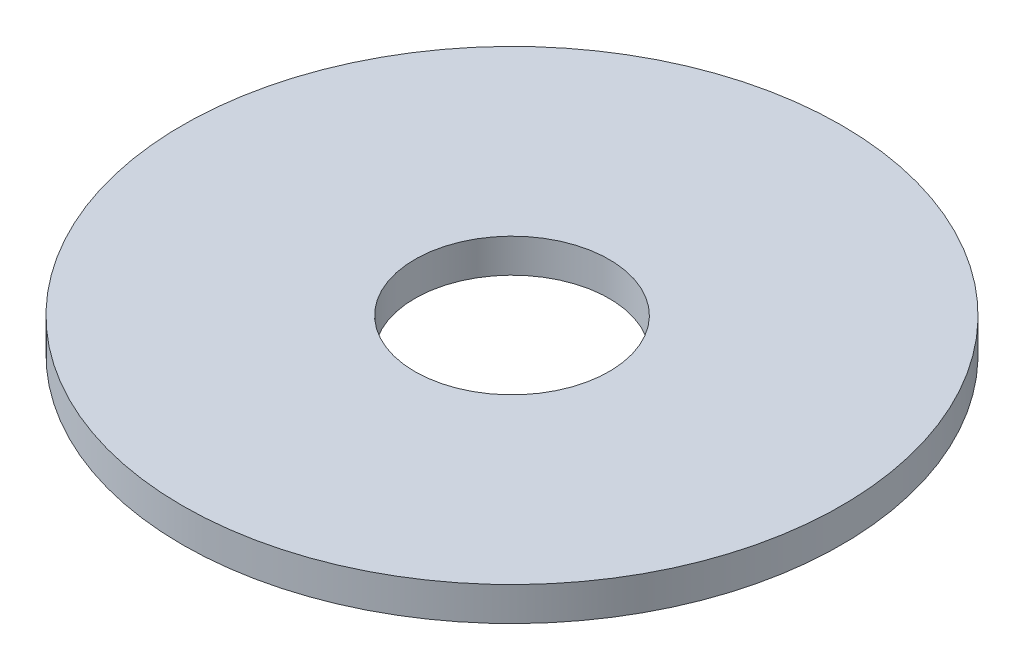
ISO-10303-21;
HEADER;
FILE_DESCRIPTION(('STEP AP214'),'2;1');
FILE_NAME('part.step','',(''),(''),'','','');
FILE_SCHEMA(('AUTOMOTIVE_DESIGN { 1 0 10303 214 1 1 1 1 }'));
ENDSEC;
DATA;
#1=APPLICATION_CONTEXT('core data for automotive mechanical design processes');
#2=APPLICATION_PROTOCOL_DEFINITION('international standard','automotive_design',2000,#1);
#3=PRODUCT_CONTEXT('',#1,'mechanical');
#4=PRODUCT('Part','Part','',(#3));
#5=PRODUCT_RELATED_PRODUCT_CATEGORY('part','',(#4));
#6=PRODUCT_DEFINITION_FORMATION('','',#4);
#7=PRODUCT_DEFINITION_CONTEXT('part definition',#1,'design');
#8=PRODUCT_DEFINITION('design','',#6,#7);
#9=PRODUCT_DEFINITION_SHAPE('','',#8);
#10=(LENGTH_UNIT() NAMED_UNIT(*) SI_UNIT(.MILLI.,.METRE.));
#11=(NAMED_UNIT(*) PLANE_ANGLE_UNIT() SI_UNIT($,.RADIAN.));
#12=(NAMED_UNIT(*) SI_UNIT($,.STERADIAN.) SOLID_ANGLE_UNIT());
#13=UNCERTAINTY_MEASURE_WITH_UNIT(LENGTH_MEASURE(1.E-05),#10,'distance_accuracy_value','');
#14=(GEOMETRIC_REPRESENTATION_CONTEXT(3) GLOBAL_UNCERTAINTY_ASSIGNED_CONTEXT((#13)) GLOBAL_UNIT_ASSIGNED_CONTEXT((#10,
#11,#12)) REPRESENTATION_CONTEXT('',''));
#15=CARTESIAN_POINT('',(0.,0.,0.));
#16=DIRECTION('',(0.,0.,1.));
#17=DIRECTION('',(1.,0.,0.));
#18=AXIS2_PLACEMENT_3D('',#15,#16,#17);
#19=CARTESIAN_POINT('',(0.,2.,0.));
#20=DIRECTION('',(0.,1.,0.));
#21=DIRECTION('',(0.,0.,1.));
#22=AXIS2_PLACEMENT_3D('',#19,#20,#21);
#23=PLANE('',#22);
#24=CARTESIAN_POINT('',(0.,2.,0.));
#25=DIRECTION('',(0.,1.,0.));
#26=DIRECTION('',(0.,0.,1.));
#27=AXIS2_PLACEMENT_3D('',#24,#25,#26);
#28=CIRCLE('',#27,19.5);
#29=CARTESIAN_POINT('',(0.,2.,19.5));
#30=VERTEX_POINT('',#29);
#31=EDGE_CURVE('E10',#30,#30,#28,.T.);
#32=ORIENTED_EDGE('',*,*,#31,.T.);
#33=EDGE_LOOP('',(#32));
#34=FACE_BOUND('',#33,.T.);
#35=CARTESIAN_POINT('',(0.,2.,0.));
#36=DIRECTION('',(0.,1.,0.));
#37=DIRECTION('',(0.,0.,1.));
#38=AXIS2_PLACEMENT_3D('',#35,#36,#37);
#39=CIRCLE('',#38,5.75);
#40=CARTESIAN_POINT('',(0.,2.,5.75));
#41=VERTEX_POINT('',#40);
#42=EDGE_CURVE('E50',#41,#41,#39,.T.);
#43=ORIENTED_EDGE('',*,*,#42,.F.);
#44=EDGE_LOOP('',(#43));
#45=FACE_BOUND('',#44,.T.);
#46=ADVANCED_FACE('F37',(#34,#45),#23,.T.);
#47=CARTESIAN_POINT('',(0.,0.,0.));
#48=DIRECTION('',(0.,1.,0.));
#49=DIRECTION('',(0.,0.,1.));
#50=AXIS2_PLACEMENT_3D('',#47,#48,#49);
#51=PLANE('',#50);
#52=CARTESIAN_POINT('',(0.,0.,0.));
#53=DIRECTION('',(0.,1.,0.));
#54=DIRECTION('',(0.,0.,1.));
#55=AXIS2_PLACEMENT_3D('',#52,#53,#54);
#56=CIRCLE('',#55,19.5);
#57=CARTESIAN_POINT('',(0.,0.,19.5));
#58=VERTEX_POINT('',#57);
#59=EDGE_CURVE('E41',#58,#58,#56,.T.);
#60=ORIENTED_EDGE('',*,*,#59,.F.);
#61=EDGE_LOOP('',(#60));
#62=FACE_BOUND('',#61,.T.);
#63=CARTESIAN_POINT('',(0.,0.,0.));
#64=DIRECTION('',(0.,1.,0.));
#65=DIRECTION('',(0.,0.,1.));
#66=AXIS2_PLACEMENT_3D('',#63,#64,#65);
#67=CIRCLE('',#66,5.75);
#68=CARTESIAN_POINT('',(0.,0.,5.75));
#69=VERTEX_POINT('',#68);
#70=EDGE_CURVE('E52',#69,#69,#67,.T.);
#71=ORIENTED_EDGE('',*,*,#70,.T.);
#72=EDGE_LOOP('',(#71));
#73=FACE_BOUND('',#72,.T.);
#74=ADVANCED_FACE('F64',(#62,#73),#51,.F.);
#75=CARTESIAN_POINT('',(0.,2.,0.));
#76=DIRECTION('',(0.,-1.,0.));
#77=DIRECTION('',(0.,0.,-1.));
#78=AXIS2_PLACEMENT_3D('',#75,#76,#77);
#79=CYLINDRICAL_SURFACE('',#78,19.5);
#80=ORIENTED_EDGE('',*,*,#31,.F.);
#81=EDGE_LOOP('',(#80));
#82=FACE_BOUND('',#81,.T.);
#83=ORIENTED_EDGE('',*,*,#59,.T.);
#84=EDGE_LOOP('',(#83));
#85=FACE_BOUND('',#84,.T.);
#86=ADVANCED_FACE('F39',(#82,#85),#79,.T.);
#87=CARTESIAN_POINT('',(0.,2.,0.));
#88=DIRECTION('',(0.,-1.,0.));
#89=DIRECTION('',(0.,0.,-1.));
#90=AXIS2_PLACEMENT_3D('',#87,#88,#89);
#91=CYLINDRICAL_SURFACE('',#90,5.75);
#92=ORIENTED_EDGE('',*,*,#42,.T.);
#93=EDGE_LOOP('',(#92));
#94=FACE_BOUND('',#93,.T.);
#95=ORIENTED_EDGE('',*,*,#70,.F.);
#96=EDGE_LOOP('',(#95));
#97=FACE_BOUND('',#96,.T.);
#98=ADVANCED_FACE('F60',(#94,#97),#91,.F.);
#99=CLOSED_SHELL('',(#46,#74,#86,#98));
#100=MANIFOLD_SOLID_BREP('B2',#99);
#101=ADVANCED_BREP_SHAPE_REPRESENTATION('',(#18,#100),#14);
#102=SHAPE_DEFINITION_REPRESENTATION(#9,#101);
ENDSEC;
END-ISO-10303-21;
